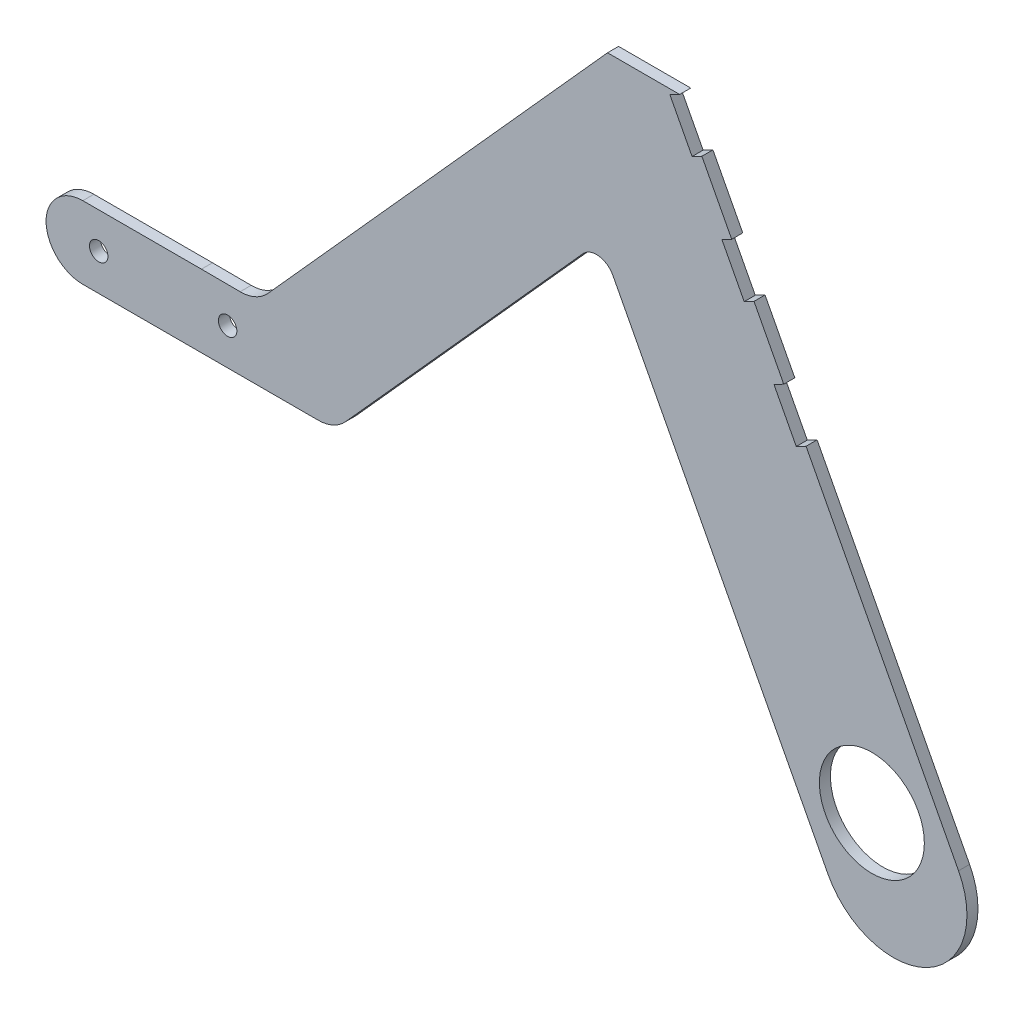
ISO-10303-21;
HEADER;
FILE_DESCRIPTION(('STEP AP214'),'2;1');
FILE_NAME('part.step','',(''),(''),'','','');
FILE_SCHEMA(('AUTOMOTIVE_DESIGN { 1 0 10303 214 1 1 1 1 }'));
ENDSEC;
DATA;
#1=APPLICATION_CONTEXT('core data for automotive mechanical design processes');
#2=APPLICATION_PROTOCOL_DEFINITION('international standard','automotive_design',2000,#1);
#3=PRODUCT_CONTEXT('',#1,'mechanical');
#4=PRODUCT('Part','Part','',(#3));
#5=PRODUCT_RELATED_PRODUCT_CATEGORY('part','',(#4));
#6=PRODUCT_DEFINITION_FORMATION('','',#4);
#7=PRODUCT_DEFINITION_CONTEXT('part definition',#1,'design');
#8=PRODUCT_DEFINITION('design','',#6,#7);
#9=PRODUCT_DEFINITION_SHAPE('','',#8);
#10=(LENGTH_UNIT() NAMED_UNIT(*) SI_UNIT(.MILLI.,.METRE.));
#11=(NAMED_UNIT(*) PLANE_ANGLE_UNIT() SI_UNIT($,.RADIAN.));
#12=(NAMED_UNIT(*) SI_UNIT($,.STERADIAN.) SOLID_ANGLE_UNIT());
#13=UNCERTAINTY_MEASURE_WITH_UNIT(LENGTH_MEASURE(1.E-05),#10,'distance_accuracy_value','');
#14=(GEOMETRIC_REPRESENTATION_CONTEXT(3) GLOBAL_UNCERTAINTY_ASSIGNED_CONTEXT((#13)) GLOBAL_UNIT_ASSIGNED_CONTEXT((#10,
#11,#12)) REPRESENTATION_CONTEXT('',''));
#15=CARTESIAN_POINT('',(0.,0.,0.));
#16=DIRECTION('',(0.,0.,1.));
#17=DIRECTION('',(1.,0.,0.));
#18=AXIS2_PLACEMENT_3D('',#15,#16,#17);
#19=CARTESIAN_POINT('',(47.5265399723287,145.283049840151,3.));
#20=DIRECTION('',(-0.886005074964163,-0.463675540801699,0.));
#21=DIRECTION('',(0.463675540801699,-0.886005074964163,0.));
#22=AXIS2_PLACEMENT_3D('',#19,#20,#21);
#23=PLANE('',#22);
#24=DIRECTION('',(-0.463675540801699,0.886005074964163,0.));
#25=VECTOR('',#24,1.);
#26=CARTESIAN_POINT('',(47.5265399723287,145.283049840151,0.));
#27=LINE('',#26,#25);
#28=CARTESIAN_POINT('',(71.0495710049199,100.334539428366,0.));
#29=VERTEX_POINT('',#28);
#30=CARTESIAN_POINT('',(62.9475619895108,115.816100290184,0.));
#31=VERTEX_POINT('',#30);
#32=EDGE_CURVE('E417',#29,#31,#27,.T.);
#33=ORIENTED_EDGE('',*,*,#32,.T.);
#34=DIRECTION('',(0.,0.,-1.));
#35=VECTOR('',#34,1.);
#36=CARTESIAN_POINT('',(62.9475619895108,115.816100290184,3.));
#37=LINE('',#36,#35);
#38=CARTESIAN_POINT('',(62.9475619895108,115.816100290184,3.));
#39=VERTEX_POINT('',#38);
#40=EDGE_CURVE('E283',#39,#31,#37,.T.);
#41=ORIENTED_EDGE('',*,*,#40,.F.);
#42=DIRECTION('',(-0.463675540801699,0.886005074964163,0.));
#43=VECTOR('',#42,1.);
#44=CARTESIAN_POINT('',(47.5265399723287,145.283049840151,3.));
#45=LINE('',#44,#43);
#46=CARTESIAN_POINT('',(71.0495710049199,100.334539428366,3.));
#47=VERTEX_POINT('',#46);
#48=EDGE_CURVE('E399',#47,#39,#45,.T.);
#49=ORIENTED_EDGE('',*,*,#48,.F.);
#50=DIRECTION('',(0.,0.,1.));
#51=VECTOR('',#50,1.);
#52=CARTESIAN_POINT('',(71.0495710049199,100.334539428366,3.));
#53=LINE('',#52,#51);
#54=EDGE_CURVE('E318',#29,#47,#53,.T.);
#55=ORIENTED_EDGE('',*,*,#54,.F.);
#56=EDGE_LOOP('',(#33,#41,#49,#55));
#57=FACE_BOUND('',#56,.T.);
#58=ADVANCED_FACE('F45',(#57),#23,.F.);
#59=CARTESIAN_POINT('',(85.1805017222918,73.3327348735877,0.));
#60=VERTEX_POINT('',#59);
#61=CARTESIAN_POINT('',(77.0996995895019,88.7737729905735,0.));
#62=VERTEX_POINT('',#61);
#63=EDGE_CURVE('E421',#60,#62,#27,.T.);
#64=ORIENTED_EDGE('',*,*,#63,.T.);
#65=DIRECTION('',(0.,0.,-1.));
#66=VECTOR('',#65,1.);
#67=CARTESIAN_POINT('',(77.0996995895019,88.7737729905735,3.));
#68=LINE('',#67,#66);
#69=CARTESIAN_POINT('',(77.0996995895018,88.7737729905735,3.));
#70=VERTEX_POINT('',#69);
#71=EDGE_CURVE('E286',#70,#62,#68,.T.);
#72=ORIENTED_EDGE('',*,*,#71,.F.);
#73=CARTESIAN_POINT('',(85.1805017222918,73.3327348735877,3.));
#74=VERTEX_POINT('',#73);
#75=EDGE_CURVE('E405',#74,#70,#45,.T.);
#76=ORIENTED_EDGE('',*,*,#75,.F.);
#77=DIRECTION('',(0.,0.,1.));
#78=VECTOR('',#77,1.);
#79=CARTESIAN_POINT('',(85.1805017222918,73.3327348735877,3.));
#80=LINE('',#79,#78);
#81=EDGE_CURVE('E351',#60,#74,#80,.T.);
#82=ORIENTED_EDGE('',*,*,#81,.F.);
#83=EDGE_LOOP('',(#64,#72,#76,#82));
#84=FACE_BOUND('',#83,.T.);
#85=ADVANCED_FACE('F563',(#84),#23,.F.);
#86=CARTESIAN_POINT('',(-135.81117841602,11.660861845859,3.));
#87=DIRECTION('',(0.,0.,-1.));
#88=DIRECTION('',(-1.,0.,0.));
#89=AXIS2_PLACEMENT_3D('',#86,#87,#88);
#90=PLANE('',#89);
#91=CARTESIAN_POINT('',(-100.811197098113,11.6246990730858,3.));
#92=DIRECTION('',(0.,0.,1.));
#93=DIRECTION('',(1.,0.,0.));
#94=AXIS2_PLACEMENT_3D('',#91,#92,#93);
#95=CIRCLE('',#94,2.5);
#96=CARTESIAN_POINT('',(-98.3111970981128,11.6246990730858,3.));
#97=VERTEX_POINT('',#96);
#98=EDGE_CURVE('E242',#97,#97,#95,.T.);
#99=ORIENTED_EDGE('',*,*,#98,.F.);
#100=EDGE_LOOP('',(#99));
#101=FACE_BOUND('',#100,.T.);
#102=CARTESIAN_POINT('',(-105.124337118393,11.3338349953504,3.));
#103=DIRECTION('',(0.,0.,-1.));
#104=DIRECTION('',(-1.,0.,0.));
#105=AXIS2_PLACEMENT_3D('',#102,#103,#104);
#106=CIRCLE('',#105,10.);
#107=CARTESIAN_POINT('',(-105.124337118393,21.3338349953504,3.));
#108=VERTEX_POINT('',#107);
#109=CARTESIAN_POINT('',(-115.123000197013,11.4973484206047,3.));
#110=VERTEX_POINT('',#109);
#111=EDGE_CURVE('E62',#108,#110,#106,.F.);
#112=ORIENTED_EDGE('',*,*,#111,.T.);
#113=CARTESIAN_POINT('',(-105.124337118393,11.660861845859,3.));
#114=DIRECTION('',(0.,0.,-1.));
#115=DIRECTION('',(-1.,0.,0.));
#116=AXIS2_PLACEMENT_3D('',#113,#114,#115);
#117=CIRCLE('',#116,10.);
#118=CARTESIAN_POINT('',(-105.124337118393,1.66086184585895,3.));
#119=VERTEX_POINT('',#118);
#120=EDGE_CURVE('E477',#110,#119,#117,.F.);
#121=ORIENTED_EDGE('',*,*,#120,.T.);
#122=DIRECTION('',(-1.,0.,0.));
#123=VECTOR('',#122,1.);
#124=CARTESIAN_POINT('',(-177.200165386353,1.66086184585895,3.));
#125=LINE('',#124,#123);
#126=CARTESIAN_POINT('',(-41.2833360384099,1.66086184585895,3.));
#127=VERTEX_POINT('',#126);
#128=EDGE_CURVE('E258',#127,#119,#125,.T.);
#129=ORIENTED_EDGE('',*,*,#128,.F.);
#130=CARTESIAN_POINT('',(-41.2833360384098,11.660861845859,3.));
#131=DIRECTION('',(0.,0.,-1.));
#132=DIRECTION('',(-1.,0.,0.));
#133=AXIS2_PLACEMENT_3D('',#130,#131,#132);
#134=CIRCLE('',#133,10.);
#135=CARTESIAN_POINT('',(-33.8452480302584,4.97693734127377,3.));
#136=VERTEX_POINT('',#135);
#137=EDGE_CURVE('E448',#127,#136,#134,.F.);
#138=ORIENTED_EDGE('',*,*,#137,.T.);
#139=DIRECTION('',(0.668392450458517,0.743808800815142,0.));
#140=VECTOR('',#139,1.);
#141=CARTESIAN_POINT('',(30.6390147016568,76.7371167107013,3.));
#142=LINE('',#141,#140);
#143=CARTESIAN_POINT('',(30.6390147016568,76.7371167107013,3.));
#144=VERTEX_POINT('',#143);
#145=EDGE_CURVE('E386',#136,#144,#142,.T.);
#146=ORIENTED_EDGE('',*,*,#145,.T.);
#147=CARTESIAN_POINT('',(34.3580587057325,73.3951544584087,3.));
#148=DIRECTION('',(0.,0.,-1.));
#149=DIRECTION('',(1.,0.,0.));
#150=AXIS2_PLACEMENT_3D('',#147,#148,#149);
#151=CIRCLE('',#150,4.99999999999999);
#152=CARTESIAN_POINT('',(38.7880840805533,75.7135321624172,3.));
#153=VERTEX_POINT('',#152);
#154=EDGE_CURVE('E389',#144,#153,#151,.T.);
#155=ORIENTED_EDGE('',*,*,#154,.T.);
#156=DIRECTION('',(0.463675540801699,-0.886005074964163,0.));
#157=VECTOR('',#156,1.);
#158=CARTESIAN_POINT('',(97.1952092686626,-35.8925474708917,3.));
#159=LINE('',#158,#157);
#160=CARTESIAN_POINT('',(97.1952092686626,-35.8925474708917,3.));
#161=VERTEX_POINT('',#160);
#162=EDGE_CURVE('E393',#153,#161,#159,.T.);
#163=ORIENTED_EDGE('',*,*,#162,.T.);
#164=CARTESIAN_POINT('',(114.915310767946,-26.6190366548578,3.));
#165=DIRECTION('',(0.,0.,1.));
#166=DIRECTION('',(-1.,0.,0.));
#167=AXIS2_PLACEMENT_3D('',#164,#165,#166);
#168=CIRCLE('',#167,20.);
#169=CARTESIAN_POINT('',(132.635412267229,-17.3455258388238,3.));
#170=VERTEX_POINT('',#169);
#171=EDGE_CURVE('E396',#161,#170,#168,.T.);
#172=ORIENTED_EDGE('',*,*,#171,.T.);
#173=CARTESIAN_POINT('',(91.2306303068737,61.7719684357956,3.));
#174=VERTEX_POINT('',#173);
#175=EDGE_CURVE('E400',#170,#174,#45,.T.);
#176=ORIENTED_EDGE('',*,*,#175,.T.);
#177=DIRECTION('',(0.886005074964163,0.463675540801699,0.));
#178=VECTOR('',#177,1.);
#179=CARTESIAN_POINT('',(88.5726150819813,60.3809418133905,3.));
#180=LINE('',#179,#178);
#181=CARTESIAN_POINT('',(88.5726150819813,60.3809418133905,3.));
#182=VERTEX_POINT('',#181);
#183=EDGE_CURVE('E337',#182,#174,#180,.T.);
#184=ORIENTED_EDGE('',*,*,#183,.F.);
#185=DIRECTION('',(0.463675540801699,-0.886005074964163,0.));
#186=VECTOR('',#185,1.);
#187=CARTESIAN_POINT('',(82.5224864973993,71.9417082511826,3.));
#188=LINE('',#187,#186);
#189=CARTESIAN_POINT('',(82.5224864973993,71.9417082511826,3.));
#190=VERTEX_POINT('',#189);
#191=EDGE_CURVE('E354',#190,#182,#188,.T.);
#192=ORIENTED_EDGE('',*,*,#191,.F.);
#193=DIRECTION('',(0.886005074964163,0.463675540801699,0.));
#194=VECTOR('',#193,1.);
#195=CARTESIAN_POINT('',(82.5224864973993,71.9417082511826,3.));
#196=LINE('',#195,#194);
#197=EDGE_CURVE('E265',#190,#74,#196,.T.);
#198=ORIENTED_EDGE('',*,*,#197,.T.);
#199=ORIENTED_EDGE('',*,*,#75,.T.);
#200=DIRECTION('',(0.886005074964163,0.463675540801699,0.));
#201=VECTOR('',#200,1.);
#202=CARTESIAN_POINT('',(74.4416843646094,87.3827463681684,3.));
#203=LINE('',#202,#201);
#204=CARTESIAN_POINT('',(74.4416843646094,87.3827463681684,3.));
#205=VERTEX_POINT('',#204);
#206=EDGE_CURVE('E302',#205,#70,#203,.T.);
#207=ORIENTED_EDGE('',*,*,#206,.F.);
#208=DIRECTION('',(0.4636755408017,-0.886005074964163,0.));
#209=VECTOR('',#208,1.);
#210=CARTESIAN_POINT('',(68.3915557800274,98.9435128059606,3.));
#211=LINE('',#210,#209);
#212=CARTESIAN_POINT('',(68.3915557800274,98.9435128059606,3.));
#213=VERTEX_POINT('',#212);
#214=EDGE_CURVE('E321',#213,#205,#211,.T.);
#215=ORIENTED_EDGE('',*,*,#214,.F.);
#216=DIRECTION('',(0.886005074964163,0.463675540801699,0.));
#217=VECTOR('',#216,1.);
#218=CARTESIAN_POINT('',(68.3915557800274,98.9435128059606,3.));
#219=LINE('',#218,#217);
#220=EDGE_CURVE('E313',#213,#47,#219,.T.);
#221=ORIENTED_EDGE('',*,*,#220,.T.);
#222=ORIENTED_EDGE('',*,*,#48,.T.);
#223=DIRECTION('',(0.886005074964163,0.463675540801699,0.));
#224=VECTOR('',#223,1.);
#225=CARTESIAN_POINT('',(60.2895467646183,114.425073667779,3.));
#226=LINE('',#225,#224);
#227=CARTESIAN_POINT('',(60.2895467646183,114.425073667779,3.));
#228=VERTEX_POINT('',#227);
#229=EDGE_CURVE('E282',#228,#39,#226,.T.);
#230=ORIENTED_EDGE('',*,*,#229,.F.);
#231=DIRECTION('',(0.4636755408017,-0.886005074964162,0.));
#232=VECTOR('',#231,1.);
#233=CARTESIAN_POINT('',(54.2606250626555,125.945317360739,3.));
#234=LINE('',#233,#232);
#235=CARTESIAN_POINT('',(54.2606250626555,125.945317360739,3.));
#236=VERTEX_POINT('',#235);
#237=EDGE_CURVE('E266',#236,#228,#234,.T.);
#238=ORIENTED_EDGE('',*,*,#237,.F.);
#239=DIRECTION('',(0.886005074964163,0.463675540801699,0.));
#240=VECTOR('',#239,1.);
#241=CARTESIAN_POINT('',(54.2606250626555,125.945317360739,3.));
#242=LINE('',#241,#240);
#243=CARTESIAN_POINT('',(56.918640287548,127.336343983144,3.));
#244=VERTEX_POINT('',#243);
#245=EDGE_CURVE('E234',#236,#244,#242,.T.);
#246=ORIENTED_EDGE('',*,*,#245,.T.);
#247=DIRECTION('',(1.,0.,0.));
#248=VECTOR('',#247,1.);
#249=CARTESIAN_POINT('',(22.3306181281122,127.336343983144,3.));
#250=LINE('',#249,#248);
#251=CARTESIAN_POINT('',(37.3306181281122,127.336343983144,3.));
#252=VERTEX_POINT('',#251);
#253=EDGE_CURVE('E217',#252,#244,#250,.T.);
#254=ORIENTED_EDGE('',*,*,#253,.F.);
#255=DIRECTION('',(-0.668121193620437,-0.744052464974885,0.));
#256=VECTOR('',#255,1.);
#257=CARTESIAN_POINT('',(-42.6343339939096,38.2834591082024,3.));
#258=LINE('',#257,#256);
#259=CARTESIAN_POINT('',(-54.9233200049385,24.5978427546783,3.));
#260=VERTEX_POINT('',#259);
#261=EDGE_CURVE('E232',#252,#260,#258,.T.);
#262=ORIENTED_EDGE('',*,*,#261,.T.);
#263=CARTESIAN_POINT('',(-62.3638446546874,31.2790546908826,3.));
#264=DIRECTION('',(0.,0.,-1.));
#265=DIRECTION('',(-1.,0.,0.));
#266=AXIS2_PLACEMENT_3D('',#263,#264,#265);
#267=CIRCLE('',#266,10.);
#268=CARTESIAN_POINT('',(-62.4158461613179,21.2791898996313,3.));
#269=VERTEX_POINT('',#268);
#270=EDGE_CURVE('E55',#260,#269,#267,.T.);
#271=ORIENTED_EDGE('',*,*,#270,.T.);
#272=DIRECTION('',(0.999986479125134,-0.00520015066304951,0.));
#273=VECTOR('',#272,1.);
#274=CARTESIAN_POINT('',(0.108965675032663,20.9540470616878,3.));
#275=LINE('',#274,#273);
#276=CARTESIAN_POINT('',(-72.9240718667576,21.3338349953504,3.));
#277=VERTEX_POINT('',#276);
#278=EDGE_CURVE('E226',#277,#269,#275,.T.);
#279=ORIENTED_EDGE('',*,*,#278,.F.);
#280=DIRECTION('',(1.,0.,0.));
#281=VECTOR('',#280,1.);
#282=CARTESIAN_POINT('',(-115.124337118393,21.3338349953504,3.));
#283=LINE('',#282,#281);
#284=EDGE_CURVE('E498',#108,#277,#283,.T.);
#285=ORIENTED_EDGE('',*,*,#284,.F.);
#286=EDGE_LOOP('',(#112,#121,#129,#138,#146,#155,#163,#172,#176,#184,#192,#198,#199,#207,#215,
#221,#222,#230,#238,#246,#254,#262,#271,#279,#285));
#287=FACE_BOUND('',#286,.T.);
#288=CARTESIAN_POINT('',(-65.8112157802054,11.5885363003127,3.));
#289=DIRECTION('',(0.,0.,1.));
#290=DIRECTION('',(1.,0.,0.));
#291=AXIS2_PLACEMENT_3D('',#288,#289,#290);
#292=CIRCLE('',#291,2.50000000000001);
#293=CARTESIAN_POINT('',(-63.3112157802054,11.5885363003127,3.));
#294=VERTEX_POINT('',#293);
#295=EDGE_CURVE('E378',#294,#294,#292,.T.);
#296=ORIENTED_EDGE('',*,*,#295,.F.);
#297=EDGE_LOOP('',(#296));
#298=FACE_BOUND('',#297,.T.);
#299=CARTESIAN_POINT('',(109.098617171966,-15.5043247668019,3.));
#300=DIRECTION('',(0.,0.,1.));
#301=DIRECTION('',(1.,0.,0.));
#302=AXIS2_PLACEMENT_3D('',#299,#300,#301);
#303=CIRCLE('',#302,14.25);
#304=CARTESIAN_POINT('',(123.348617171966,-15.5043247668019,3.));
#305=VERTEX_POINT('',#304);
#306=EDGE_CURVE('E370',#305,#305,#303,.T.);
#307=ORIENTED_EDGE('',*,*,#306,.F.);
#308=EDGE_LOOP('',(#307));
#309=FACE_BOUND('',#308,.T.);
#310=ADVANCED_FACE('F230',(#101,#287,#298,#309),#90,.F.);
#311=CARTESIAN_POINT('',(-135.81117841602,11.660861845859,0.));
#312=DIRECTION('',(0.,0.,-1.));
#313=DIRECTION('',(-1.,0.,0.));
#314=AXIS2_PLACEMENT_3D('',#311,#312,#313);
#315=PLANE('',#314);
#316=DIRECTION('',(1.,0.,0.));
#317=VECTOR('',#316,1.);
#318=CARTESIAN_POINT('',(-135.81117841602,1.66086184585895,0.));
#319=LINE('',#318,#317);
#320=CARTESIAN_POINT('',(-105.124337118393,1.66086184585895,0.));
#321=VERTEX_POINT('',#320);
#322=CARTESIAN_POINT('',(-41.2833360384098,1.66086184585895,0.));
#323=VERTEX_POINT('',#322);
#324=EDGE_CURVE('E262',#321,#323,#319,.T.);
#325=ORIENTED_EDGE('',*,*,#324,.F.);
#326=CARTESIAN_POINT('',(-105.124337118393,11.660861845859,0.));
#327=DIRECTION('',(0.,0.,-1.));
#328=DIRECTION('',(-1.,0.,0.));
#329=AXIS2_PLACEMENT_3D('',#326,#327,#328);
#330=CIRCLE('',#329,10.);
#331=CARTESIAN_POINT('',(-115.123000197013,11.4973484206047,0.));
#332=VERTEX_POINT('',#331);
#333=EDGE_CURVE('E472',#321,#332,#330,.T.);
#334=ORIENTED_EDGE('',*,*,#333,.T.);
#335=CARTESIAN_POINT('',(-105.124337118393,11.3338349953504,0.));
#336=DIRECTION('',(0.,0.,-1.));
#337=DIRECTION('',(-1.,0.,0.));
#338=AXIS2_PLACEMENT_3D('',#335,#336,#337);
#339=CIRCLE('',#338,10.);
#340=CARTESIAN_POINT('',(-105.124337118393,21.3338349953504,0.));
#341=VERTEX_POINT('',#340);
#342=EDGE_CURVE('E469',#332,#341,#339,.T.);
#343=ORIENTED_EDGE('',*,*,#342,.T.);
#344=DIRECTION('',(-1.,0.,0.));
#345=VECTOR('',#344,1.);
#346=CARTESIAN_POINT('',(-135.81117841602,21.3338349953504,0.));
#347=LINE('',#346,#345);
#348=CARTESIAN_POINT('',(-72.9240718667576,21.3338349953504,0.));
#349=VERTEX_POINT('',#348);
#350=EDGE_CURVE('E249',#349,#341,#347,.T.);
#351=ORIENTED_EDGE('',*,*,#350,.F.);
#352=DIRECTION('',(-0.999986479125134,0.00520015066304951,0.));
#353=VECTOR('',#352,1.);
#354=CARTESIAN_POINT('',(-135.759177612496,21.6605914301897,0.));
#355=LINE('',#354,#353);
#356=CARTESIAN_POINT('',(-62.4158461613179,21.2791898996313,0.));
#357=VERTEX_POINT('',#356);
#358=EDGE_CURVE('E457',#357,#349,#355,.T.);
#359=ORIENTED_EDGE('',*,*,#358,.F.);
#360=CARTESIAN_POINT('',(-62.3638446546874,31.2790546908826,0.));
#361=DIRECTION('',(0.,0.,-1.));
#362=DIRECTION('',(-1.,0.,0.));
#363=AXIS2_PLACEMENT_3D('',#360,#361,#362);
#364=CIRCLE('',#363,10.);
#365=CARTESIAN_POINT('',(-54.9233200049385,24.5978427546783,0.));
#366=VERTEX_POINT('',#365);
#367=EDGE_CURVE('E11',#357,#366,#364,.F.);
#368=ORIENTED_EDGE('',*,*,#367,.T.);
#369=DIRECTION('',(0.668121193620437,0.744052464974885,0.));
#370=VECTOR('',#369,1.);
#371=CARTESIAN_POINT('',(-97.4617178538169,-22.7749992951749,0.));
#372=LINE('',#371,#370);
#373=CARTESIAN_POINT('',(37.3306181281122,127.336343983144,0.));
#374=VERTEX_POINT('',#373);
#375=EDGE_CURVE('E451',#366,#374,#372,.T.);
#376=ORIENTED_EDGE('',*,*,#375,.T.);
#377=DIRECTION('',(-1.,0.,0.));
#378=VECTOR('',#377,1.);
#379=CARTESIAN_POINT('',(-135.81117841602,127.336343983144,0.));
#380=LINE('',#379,#378);
#381=CARTESIAN_POINT('',(56.918640287548,127.336343983144,0.));
#382=VERTEX_POINT('',#381);
#383=EDGE_CURVE('E220',#382,#374,#380,.T.);
#384=ORIENTED_EDGE('',*,*,#383,.F.);
#385=DIRECTION('',(0.886005074964163,0.463675540801699,0.));
#386=VECTOR('',#385,1.);
#387=CARTESIAN_POINT('',(54.2606250626555,125.945317360739,0.));
#388=LINE('',#387,#386);
#389=CARTESIAN_POINT('',(54.2606250626555,125.945317360739,0.));
#390=VERTEX_POINT('',#389);
#391=EDGE_CURVE('E292',#390,#382,#388,.T.);
#392=ORIENTED_EDGE('',*,*,#391,.F.);
#393=DIRECTION('',(-0.4636755408017,0.886005074964162,0.));
#394=VECTOR('',#393,1.);
#395=CARTESIAN_POINT('',(54.2606250626555,125.945317360739,0.));
#396=LINE('',#395,#394);
#397=CARTESIAN_POINT('',(60.2895467646183,114.425073667779,0.));
#398=VERTEX_POINT('',#397);
#399=EDGE_CURVE('E275',#398,#390,#396,.T.);
#400=ORIENTED_EDGE('',*,*,#399,.F.);
#401=DIRECTION('',(0.886005074964163,0.463675540801699,0.));
#402=VECTOR('',#401,1.);
#403=CARTESIAN_POINT('',(60.2895467646183,114.425073667779,0.));
#404=LINE('',#403,#402);
#405=EDGE_CURVE('E296',#398,#31,#404,.T.);
#406=ORIENTED_EDGE('',*,*,#405,.T.);
#407=ORIENTED_EDGE('',*,*,#32,.F.);
#408=DIRECTION('',(0.886005074964163,0.463675540801699,0.));
#409=VECTOR('',#408,1.);
#410=CARTESIAN_POINT('',(68.3915557800274,98.9435128059606,0.));
#411=LINE('',#410,#409);
#412=CARTESIAN_POINT('',(68.3915557800274,98.9435128059606,0.));
#413=VERTEX_POINT('',#412);
#414=EDGE_CURVE('E310',#413,#29,#411,.T.);
#415=ORIENTED_EDGE('',*,*,#414,.F.);
#416=DIRECTION('',(-0.4636755408017,0.886005074964163,0.));
#417=VECTOR('',#416,1.);
#418=CARTESIAN_POINT('',(68.3915557800274,98.9435128059606,0.));
#419=LINE('',#418,#417);
#420=CARTESIAN_POINT('',(74.4416843646094,87.3827463681684,0.));
#421=VERTEX_POINT('',#420);
#422=EDGE_CURVE('E327',#421,#413,#419,.T.);
#423=ORIENTED_EDGE('',*,*,#422,.F.);
#424=DIRECTION('',(0.886005074964163,0.463675540801699,0.));
#425=VECTOR('',#424,1.);
#426=CARTESIAN_POINT('',(74.4416843646094,87.3827463681684,0.));
#427=LINE('',#426,#425);
#428=EDGE_CURVE('E306',#421,#62,#427,.T.);
#429=ORIENTED_EDGE('',*,*,#428,.T.);
#430=ORIENTED_EDGE('',*,*,#63,.F.);
#431=DIRECTION('',(0.886005074964163,0.463675540801699,0.));
#432=VECTOR('',#431,1.);
#433=CARTESIAN_POINT('',(82.5224864973993,71.9417082511826,0.));
#434=LINE('',#433,#432);
#435=CARTESIAN_POINT('',(82.5224864973993,71.9417082511826,0.));
#436=VERTEX_POINT('',#435);
#437=EDGE_CURVE('E345',#436,#60,#434,.T.);
#438=ORIENTED_EDGE('',*,*,#437,.F.);
#439=DIRECTION('',(-0.463675540801699,0.886005074964163,0.));
#440=VECTOR('',#439,1.);
#441=CARTESIAN_POINT('',(82.5224864973993,71.9417082511826,0.));
#442=LINE('',#441,#440);
#443=CARTESIAN_POINT('',(88.5726150819813,60.3809418133905,0.));
#444=VERTEX_POINT('',#443);
#445=EDGE_CURVE('E360',#444,#436,#442,.T.);
#446=ORIENTED_EDGE('',*,*,#445,.F.);
#447=DIRECTION('',(0.886005074964163,0.463675540801699,0.));
#448=VECTOR('',#447,1.);
#449=CARTESIAN_POINT('',(88.5726150819813,60.3809418133905,0.));
#450=LINE('',#449,#448);
#451=CARTESIAN_POINT('',(91.2306303068737,61.7719684357956,0.));
#452=VERTEX_POINT('',#451);
#453=EDGE_CURVE('E341',#444,#452,#450,.T.);
#454=ORIENTED_EDGE('',*,*,#453,.T.);
#455=CARTESIAN_POINT('',(132.635412267229,-17.3455258388238,0.));
#456=VERTEX_POINT('',#455);
#457=EDGE_CURVE('E390',#456,#452,#27,.T.);
#458=ORIENTED_EDGE('',*,*,#457,.F.);
#459=CARTESIAN_POINT('',(114.915310767946,-26.6190366548578,0.));
#460=DIRECTION('',(0.,0.,1.));
#461=DIRECTION('',(-1.,0.,0.));
#462=AXIS2_PLACEMENT_3D('',#459,#460,#461);
#463=CIRCLE('',#462,20.);
#464=CARTESIAN_POINT('',(97.1952092686626,-35.8925474708917,0.));
#465=VERTEX_POINT('',#464);
#466=EDGE_CURVE('E414',#465,#456,#463,.T.);
#467=ORIENTED_EDGE('',*,*,#466,.F.);
#468=DIRECTION('',(0.463675540801699,-0.886005074964163,0.));
#469=VECTOR('',#468,1.);
#470=CARTESIAN_POINT('',(97.1952092686626,-35.8925474708917,0.));
#471=LINE('',#470,#469);
#472=CARTESIAN_POINT('',(38.7880840805533,75.7135321624172,0.));
#473=VERTEX_POINT('',#472);
#474=EDGE_CURVE('E411',#473,#465,#471,.T.);
#475=ORIENTED_EDGE('',*,*,#474,.F.);
#476=CARTESIAN_POINT('',(34.3580587057325,73.3951544584087,0.));
#477=DIRECTION('',(0.,0.,-1.));
#478=DIRECTION('',(1.,0.,0.));
#479=AXIS2_PLACEMENT_3D('',#476,#477,#478);
#480=CIRCLE('',#479,4.99999999999999);
#481=CARTESIAN_POINT('',(30.6390147016568,76.7371167107013,0.));
#482=VERTEX_POINT('',#481);
#483=EDGE_CURVE('E408',#482,#473,#480,.T.);
#484=ORIENTED_EDGE('',*,*,#483,.F.);
#485=DIRECTION('',(0.668392450458517,0.743808800815142,0.));
#486=VECTOR('',#485,1.);
#487=CARTESIAN_POINT('',(30.6390147016568,76.7371167107013,0.));
#488=LINE('',#487,#486);
#489=CARTESIAN_POINT('',(-33.8452480302584,4.97693734127377,0.));
#490=VERTEX_POINT('',#489);
#491=EDGE_CURVE('E382',#490,#482,#488,.T.);
#492=ORIENTED_EDGE('',*,*,#491,.F.);
#493=CARTESIAN_POINT('',(-41.2833360384098,11.660861845859,0.));
#494=DIRECTION('',(0.,0.,-1.));
#495=DIRECTION('',(-1.,0.,0.));
#496=AXIS2_PLACEMENT_3D('',#493,#494,#495);
#497=CIRCLE('',#496,10.);
#498=EDGE_CURVE('E441',#490,#323,#497,.T.);
#499=ORIENTED_EDGE('',*,*,#498,.T.);
#500=EDGE_LOOP('',(#325,#334,#343,#351,#359,#368,#376,#384,#392,#400,#406,#407,#415,#423,#429,
#430,#438,#446,#454,#458,#467,#475,#484,#492,#499));
#501=FACE_BOUND('',#500,.T.);
#502=CARTESIAN_POINT('',(-100.811197098113,11.6246990730858,0.));
#503=DIRECTION('',(0.,0.,-1.));
#504=DIRECTION('',(-1.,0.,0.));
#505=AXIS2_PLACEMENT_3D('',#502,#503,#504);
#506=CIRCLE('',#505,2.5);
#507=CARTESIAN_POINT('',(-103.311197098113,11.6246990730858,0.));
#508=VERTEX_POINT('',#507);
#509=EDGE_CURVE('E256',#508,#508,#506,.T.);
#510=ORIENTED_EDGE('',*,*,#509,.F.);
#511=EDGE_LOOP('',(#510));
#512=FACE_BOUND('',#511,.T.);
#513=CARTESIAN_POINT('',(-65.8112157802054,11.5885363003127,0.));
#514=DIRECTION('',(0.,0.,1.));
#515=DIRECTION('',(1.,0.,0.));
#516=AXIS2_PLACEMENT_3D('',#513,#514,#515);
#517=CIRCLE('',#516,2.50000000000001);
#518=CARTESIAN_POINT('',(-63.3112157802054,11.5885363003127,0.));
#519=VERTEX_POINT('',#518);
#520=EDGE_CURVE('E374',#519,#519,#517,.T.);
#521=ORIENTED_EDGE('',*,*,#520,.T.);
#522=EDGE_LOOP('',(#521));
#523=FACE_BOUND('',#522,.T.);
#524=CARTESIAN_POINT('',(109.098617171966,-15.5043247668019,0.));
#525=DIRECTION('',(0.,0.,1.));
#526=DIRECTION('',(1.,0.,0.));
#527=AXIS2_PLACEMENT_3D('',#524,#525,#526);
#528=CIRCLE('',#527,14.25);
#529=CARTESIAN_POINT('',(123.348617171966,-15.5043247668019,0.));
#530=VERTEX_POINT('',#529);
#531=EDGE_CURVE('E291',#530,#530,#528,.T.);
#532=ORIENTED_EDGE('',*,*,#531,.T.);
#533=EDGE_LOOP('',(#532));
#534=FACE_BOUND('',#533,.T.);
#535=ADVANCED_FACE('F494',(#501,#512,#523,#534),#315,.T.);
#536=CARTESIAN_POINT('',(30.6390147016568,76.7371167107013,3.));
#537=DIRECTION('',(-0.743808800815142,0.668392450458517,0.));
#538=DIRECTION('',(-0.668392450458517,-0.743808800815142,0.));
#539=AXIS2_PLACEMENT_3D('',#536,#537,#538);
#540=PLANE('',#539);
#541=ORIENTED_EDGE('',*,*,#145,.F.);
#542=DIRECTION('',(0.,0.,-1.));
#543=VECTOR('',#542,1.);
#544=CARTESIAN_POINT('',(-33.8452480302584,4.97693734127377,3.));
#545=LINE('',#544,#543);
#546=EDGE_CURVE('E437',#136,#490,#545,.T.);
#547=ORIENTED_EDGE('',*,*,#546,.T.);
#548=ORIENTED_EDGE('',*,*,#491,.T.);
#549=DIRECTION('',(0.,0.,-1.));
#550=VECTOR('',#549,1.);
#551=CARTESIAN_POINT('',(30.6390147016568,76.7371167107013,3.));
#552=LINE('',#551,#550);
#553=EDGE_CURVE('E433',#144,#482,#552,.T.);
#554=ORIENTED_EDGE('',*,*,#553,.F.);
#555=EDGE_LOOP('',(#541,#547,#548,#554));
#556=FACE_BOUND('',#555,.T.);
#557=ADVANCED_FACE('F522',(#556),#540,.F.);
#558=CARTESIAN_POINT('',(34.3580587057325,73.3951544584087,3.));
#559=DIRECTION('',(0.,0.,-1.));
#560=DIRECTION('',(-1.,0.,0.));
#561=AXIS2_PLACEMENT_3D('',#558,#559,#560);
#562=CYLINDRICAL_SURFACE('',#561,4.99999999999999);
#563=ORIENTED_EDGE('',*,*,#483,.T.);
#564=DIRECTION('',(0.,0.,-1.));
#565=VECTOR('',#564,1.);
#566=CARTESIAN_POINT('',(38.7880840805533,75.7135321624172,3.));
#567=LINE('',#566,#565);
#568=EDGE_CURVE('E429',#153,#473,#567,.T.);
#569=ORIENTED_EDGE('',*,*,#568,.F.);
#570=ORIENTED_EDGE('',*,*,#154,.F.);
#571=ORIENTED_EDGE('',*,*,#553,.T.);
#572=EDGE_LOOP('',(#563,#569,#570,#571));
#573=FACE_BOUND('',#572,.T.);
#574=ADVANCED_FACE('F529',(#573),#562,.F.);
#575=CARTESIAN_POINT('',(97.1952092686626,-35.8925474708917,3.));
#576=DIRECTION('',(0.886005074964163,0.463675540801699,0.));
#577=DIRECTION('',(-0.463675540801699,0.886005074964163,0.));
#578=AXIS2_PLACEMENT_3D('',#575,#576,#577);
#579=PLANE('',#578);
#580=ORIENTED_EDGE('',*,*,#474,.T.);
#581=DIRECTION('',(0.,0.,-1.));
#582=VECTOR('',#581,1.);
#583=CARTESIAN_POINT('',(97.1952092686626,-35.8925474708917,3.));
#584=LINE('',#583,#582);
#585=EDGE_CURVE('E425',#161,#465,#584,.T.);
#586=ORIENTED_EDGE('',*,*,#585,.F.);
#587=ORIENTED_EDGE('',*,*,#162,.F.);
#588=ORIENTED_EDGE('',*,*,#568,.T.);
#589=EDGE_LOOP('',(#580,#586,#587,#588));
#590=FACE_BOUND('',#589,.T.);
#591=ADVANCED_FACE('F533',(#590),#579,.F.);
#592=CARTESIAN_POINT('',(114.915310767946,-26.6190366548578,3.));
#593=DIRECTION('',(0.,0.,-1.));
#594=DIRECTION('',(-1.,0.,0.));
#595=AXIS2_PLACEMENT_3D('',#592,#593,#594);
#596=CYLINDRICAL_SURFACE('',#595,20.);
#597=ORIENTED_EDGE('',*,*,#466,.T.);
#598=DIRECTION('',(0.,0.,-1.));
#599=VECTOR('',#598,1.);
#600=CARTESIAN_POINT('',(132.635412267229,-17.3455258388238,3.));
#601=LINE('',#600,#599);
#602=EDGE_CURVE('E404',#170,#456,#601,.T.);
#603=ORIENTED_EDGE('',*,*,#602,.F.);
#604=ORIENTED_EDGE('',*,*,#171,.F.);
#605=ORIENTED_EDGE('',*,*,#585,.T.);
#606=EDGE_LOOP('',(#597,#603,#604,#605));
#607=FACE_BOUND('',#606,.T.);
#608=ADVANCED_FACE('F540',(#607),#596,.T.);
#609=ORIENTED_EDGE('',*,*,#457,.T.);
#610=DIRECTION('',(0.,0.,-1.));
#611=VECTOR('',#610,1.);
#612=CARTESIAN_POINT('',(91.2306303068737,61.7719684357956,3.));
#613=LINE('',#612,#611);
#614=EDGE_CURVE('E317',#174,#452,#613,.T.);
#615=ORIENTED_EDGE('',*,*,#614,.F.);
#616=ORIENTED_EDGE('',*,*,#175,.F.);
#617=ORIENTED_EDGE('',*,*,#602,.T.);
#618=EDGE_LOOP('',(#609,#615,#616,#617));
#619=FACE_BOUND('',#618,.T.);
#620=ADVANCED_FACE('F544',(#619),#23,.F.);
#621=CARTESIAN_POINT('',(-65.8112157802054,11.5885363003127,3.));
#622=DIRECTION('',(0.,0.,-1.));
#623=DIRECTION('',(-1.,0.,0.));
#624=AXIS2_PLACEMENT_3D('',#621,#622,#623);
#625=CYLINDRICAL_SURFACE('',#624,2.50000000000001);
#626=ORIENTED_EDGE('',*,*,#295,.T.);
#627=EDGE_LOOP('',(#626));
#628=FACE_BOUND('',#627,.T.);
#629=ORIENTED_EDGE('',*,*,#520,.F.);
#630=EDGE_LOOP('',(#629));
#631=FACE_BOUND('',#630,.T.);
#632=ADVANCED_FACE('F605',(#628,#631),#625,.F.);
#633=CARTESIAN_POINT('',(109.098617171966,-15.5043247668019,3.));
#634=DIRECTION('',(0.,0.,-1.));
#635=DIRECTION('',(-1.,0.,0.));
#636=AXIS2_PLACEMENT_3D('',#633,#634,#635);
#637=CYLINDRICAL_SURFACE('',#636,14.25);
#638=ORIENTED_EDGE('',*,*,#306,.T.);
#639=EDGE_LOOP('',(#638));
#640=FACE_BOUND('',#639,.T.);
#641=ORIENTED_EDGE('',*,*,#531,.F.);
#642=EDGE_LOOP('',(#641));
#643=FACE_BOUND('',#642,.T.);
#644=ADVANCED_FACE('F610',(#640,#643),#637,.F.);
#645=CARTESIAN_POINT('',(82.5224864973993,71.9417082511826,3.));
#646=DIRECTION('',(-0.463675540801699,0.886005074964163,0.));
#647=DIRECTION('',(-0.886005074964163,-0.463675540801699,0.));
#648=AXIS2_PLACEMENT_3D('',#645,#646,#647);
#649=PLANE('',#648);
#650=ORIENTED_EDGE('',*,*,#81,.T.);
#651=ORIENTED_EDGE('',*,*,#197,.F.);
#652=DIRECTION('',(0.,0.,1.));
#653=VECTOR('',#652,1.);
#654=CARTESIAN_POINT('',(82.5224864973993,71.9417082511826,3.));
#655=LINE('',#654,#653);
#656=EDGE_CURVE('E340',#436,#190,#655,.T.);
#657=ORIENTED_EDGE('',*,*,#656,.F.);
#658=ORIENTED_EDGE('',*,*,#437,.T.);
#659=EDGE_LOOP('',(#650,#651,#657,#658));
#660=FACE_BOUND('',#659,.T.);
#661=ADVANCED_FACE('F555',(#660),#649,.F.);
#662=CARTESIAN_POINT('',(88.5726150819813,60.3809418133905,3.));
#663=DIRECTION('',(0.463675540801699,-0.886005074964163,0.));
#664=DIRECTION('',(0.886005074964163,0.463675540801699,0.));
#665=AXIS2_PLACEMENT_3D('',#662,#663,#664);
#666=PLANE('',#665);
#667=ORIENTED_EDGE('',*,*,#614,.T.);
#668=ORIENTED_EDGE('',*,*,#453,.F.);
#669=DIRECTION('',(0.,0.,-1.));
#670=VECTOR('',#669,1.);
#671=CARTESIAN_POINT('',(88.5726150819813,60.3809418133905,3.));
#672=LINE('',#671,#670);
#673=EDGE_CURVE('E363',#182,#444,#672,.T.);
#674=ORIENTED_EDGE('',*,*,#673,.F.);
#675=ORIENTED_EDGE('',*,*,#183,.T.);
#676=EDGE_LOOP('',(#667,#668,#674,#675));
#677=FACE_BOUND('',#676,.T.);
#678=ADVANCED_FACE('F546',(#677),#666,.F.);
#679=CARTESIAN_POINT('',(94.3355760974386,49.3689037453752,0.));
#680=DIRECTION('',(0.886005074964163,0.463675540801699,0.));
#681=DIRECTION('',(-0.463675540801699,0.886005074964163,0.));
#682=AXIS2_PLACEMENT_3D('',#679,#680,#681);
#683=PLANE('',#682);
#684=ORIENTED_EDGE('',*,*,#191,.T.);
#685=ORIENTED_EDGE('',*,*,#673,.T.);
#686=ORIENTED_EDGE('',*,*,#445,.T.);
#687=ORIENTED_EDGE('',*,*,#656,.T.);
#688=EDGE_LOOP('',(#684,#685,#686,#687));
#689=FACE_BOUND('',#688,.T.);
#690=ADVANCED_FACE('F552',(#689),#683,.T.);
#691=CARTESIAN_POINT('',(68.3915557800274,98.9435128059606,3.));
#692=DIRECTION('',(-0.463675540801699,0.886005074964163,0.));
#693=DIRECTION('',(-0.886005074964163,-0.463675540801699,0.));
#694=AXIS2_PLACEMENT_3D('',#691,#692,#693);
#695=PLANE('',#694);
#696=ORIENTED_EDGE('',*,*,#54,.T.);
#697=ORIENTED_EDGE('',*,*,#220,.F.);
#698=DIRECTION('',(0.,0.,1.));
#699=VECTOR('',#698,1.);
#700=CARTESIAN_POINT('',(68.3915557800274,98.9435128059606,3.));
#701=LINE('',#700,#699);
#702=EDGE_CURVE('E305',#413,#213,#701,.T.);
#703=ORIENTED_EDGE('',*,*,#702,.F.);
#704=ORIENTED_EDGE('',*,*,#414,.T.);
#705=EDGE_LOOP('',(#696,#697,#703,#704));
#706=FACE_BOUND('',#705,.T.);
#707=ADVANCED_FACE('F707',(#706),#695,.F.);
#708=CARTESIAN_POINT('',(74.4416843646094,87.3827463681684,3.));
#709=DIRECTION('',(0.463675540801699,-0.886005074964163,0.));
#710=DIRECTION('',(0.886005074964163,0.463675540801699,0.));
#711=AXIS2_PLACEMENT_3D('',#708,#709,#710);
#712=PLANE('',#711);
#713=ORIENTED_EDGE('',*,*,#71,.T.);
#714=ORIENTED_EDGE('',*,*,#428,.F.);
#715=DIRECTION('',(0.,0.,-1.));
#716=VECTOR('',#715,1.);
#717=CARTESIAN_POINT('',(74.4416843646094,87.3827463681684,3.));
#718=LINE('',#717,#716);
#719=EDGE_CURVE('E330',#205,#421,#718,.T.);
#720=ORIENTED_EDGE('',*,*,#719,.F.);
#721=ORIENTED_EDGE('',*,*,#206,.T.);
#722=EDGE_LOOP('',(#713,#714,#720,#721));
#723=FACE_BOUND('',#722,.T.);
#724=ADVANCED_FACE('F593',(#723),#712,.F.);
#725=CARTESIAN_POINT('',(94.3355760974387,49.3689037453753,0.));
#726=DIRECTION('',(0.886005074964163,0.4636755408017,0.));
#727=DIRECTION('',(-0.4636755408017,0.886005074964163,0.));
#728=AXIS2_PLACEMENT_3D('',#725,#726,#727);
#729=PLANE('',#728);
#730=ORIENTED_EDGE('',*,*,#214,.T.);
#731=ORIENTED_EDGE('',*,*,#719,.T.);
#732=ORIENTED_EDGE('',*,*,#422,.T.);
#733=ORIENTED_EDGE('',*,*,#702,.T.);
#734=EDGE_LOOP('',(#730,#731,#732,#733));
#735=FACE_BOUND('',#734,.T.);
#736=ADVANCED_FACE('F586',(#735),#729,.T.);
#737=CARTESIAN_POINT('',(54.2606250626555,125.945317360739,3.));
#738=DIRECTION('',(-0.463675540801699,0.886005074964163,0.));
#739=DIRECTION('',(-0.886005074964163,-0.463675540801699,0.));
#740=AXIS2_PLACEMENT_3D('',#737,#738,#739);
#741=PLANE('',#740);
#742=DIRECTION('',(0.,0.,1.));
#743=VECTOR('',#742,1.);
#744=CARTESIAN_POINT('',(56.918640287548,127.336343983144,3.));
#745=LINE('',#744,#743);
#746=EDGE_CURVE('E271',#382,#244,#745,.T.);
#747=ORIENTED_EDGE('',*,*,#746,.T.);
#748=ORIENTED_EDGE('',*,*,#245,.F.);
#749=DIRECTION('',(0.,0.,1.));
#750=VECTOR('',#749,1.);
#751=CARTESIAN_POINT('',(54.2606250626555,125.945317360739,3.));
#752=LINE('',#751,#750);
#753=EDGE_CURVE('E278',#390,#236,#752,.T.);
#754=ORIENTED_EDGE('',*,*,#753,.F.);
#755=ORIENTED_EDGE('',*,*,#391,.T.);
#756=EDGE_LOOP('',(#747,#748,#754,#755));
#757=FACE_BOUND('',#756,.T.);
#758=ADVANCED_FACE('F584',(#757),#741,.F.);
#759=CARTESIAN_POINT('',(60.2895467646183,114.425073667779,3.));
#760=DIRECTION('',(0.463675540801699,-0.886005074964163,0.));
#761=DIRECTION('',(0.886005074964163,0.463675540801699,0.));
#762=AXIS2_PLACEMENT_3D('',#759,#760,#761);
#763=PLANE('',#762);
#764=ORIENTED_EDGE('',*,*,#40,.T.);
#765=ORIENTED_EDGE('',*,*,#405,.F.);
#766=DIRECTION('',(0.,0.,-1.));
#767=VECTOR('',#766,1.);
#768=CARTESIAN_POINT('',(60.2895467646183,114.425073667779,3.));
#769=LINE('',#768,#767);
#770=EDGE_CURVE('E270',#228,#398,#769,.T.);
#771=ORIENTED_EDGE('',*,*,#770,.F.);
#772=ORIENTED_EDGE('',*,*,#229,.T.);
#773=EDGE_LOOP('',(#764,#765,#771,#772));
#774=FACE_BOUND('',#773,.T.);
#775=ADVANCED_FACE('F576',(#774),#763,.F.);
#776=CARTESIAN_POINT('',(94.3355760974387,49.3689037453753,0.));
#777=DIRECTION('',(0.886005074964163,0.4636755408017,0.));
#778=DIRECTION('',(-0.4636755408017,0.886005074964163,0.));
#779=AXIS2_PLACEMENT_3D('',#776,#777,#778);
#780=PLANE('',#779);
#781=ORIENTED_EDGE('',*,*,#237,.T.);
#782=ORIENTED_EDGE('',*,*,#770,.T.);
#783=ORIENTED_EDGE('',*,*,#399,.T.);
#784=ORIENTED_EDGE('',*,*,#753,.T.);
#785=EDGE_LOOP('',(#781,#782,#783,#784));
#786=FACE_BOUND('',#785,.T.);
#787=ADVANCED_FACE('F582',(#786),#780,.T.);
#788=CARTESIAN_POINT('',(-177.200165386353,1.66086184585895,-7.));
#789=DIRECTION('',(0.,1.,0.));
#790=DIRECTION('',(0.,0.,1.));
#791=AXIS2_PLACEMENT_3D('',#788,#789,#790);
#792=PLANE('',#791);
#793=ORIENTED_EDGE('',*,*,#128,.T.);
#794=DIRECTION('',(0.,0.,-1.));
#795=VECTOR('',#794,1.);
#796=CARTESIAN_POINT('',(-105.124337118393,1.66086184585895,-7.));
#797=LINE('',#796,#795);
#798=EDGE_CURVE('E465',#119,#321,#797,.T.);
#799=ORIENTED_EDGE('',*,*,#798,.T.);
#800=ORIENTED_EDGE('',*,*,#324,.T.);
#801=DIRECTION('',(0.,0.,-1.));
#802=VECTOR('',#801,1.);
#803=CARTESIAN_POINT('',(-41.2833360384099,1.66086184585895,-7.));
#804=LINE('',#803,#802);
#805=EDGE_CURVE('E445',#323,#127,#804,.F.);
#806=ORIENTED_EDGE('',*,*,#805,.T.);
#807=EDGE_LOOP('',(#793,#799,#800,#806));
#808=FACE_BOUND('',#807,.T.);
#809=ADVANCED_FACE('F514',(#808),#792,.F.);
#810=CARTESIAN_POINT('',(-41.2833360384098,11.660861845859,3.));
#811=DIRECTION('',(0.,0.,-1.));
#812=DIRECTION('',(-1.,0.,0.));
#813=AXIS2_PLACEMENT_3D('',#810,#811,#812);
#814=CYLINDRICAL_SURFACE('',#813,10.);
#815=ORIENTED_EDGE('',*,*,#137,.F.);
#816=ORIENTED_EDGE('',*,*,#805,.F.);
#817=ORIENTED_EDGE('',*,*,#498,.F.);
#818=ORIENTED_EDGE('',*,*,#546,.F.);
#819=EDGE_LOOP('',(#815,#816,#817,#818));
#820=FACE_BOUND('',#819,.T.);
#821=ADVANCED_FACE('F520',(#820),#814,.T.);
#822=CARTESIAN_POINT('',(-42.6343339939096,38.2834591082024,-7.));
#823=DIRECTION('',(-0.744052464974885,0.668121193620437,0.));
#824=DIRECTION('',(-0.668121193620437,-0.744052464974885,0.));
#825=AXIS2_PLACEMENT_3D('',#822,#823,#824);
#826=PLANE('',#825);
#827=ORIENTED_EDGE('',*,*,#375,.F.);
#828=DIRECTION('',(0.,0.,1.));
#829=VECTOR('',#828,1.);
#830=CARTESIAN_POINT('',(-54.9233200049385,24.5978427546783,-7.));
#831=LINE('',#830,#829);
#832=EDGE_CURVE('E240',#366,#260,#831,.T.);
#833=ORIENTED_EDGE('',*,*,#832,.T.);
#834=ORIENTED_EDGE('',*,*,#261,.F.);
#835=DIRECTION('',(0.,0.,1.));
#836=VECTOR('',#835,1.);
#837=CARTESIAN_POINT('',(37.3306181281122,127.336343983144,-7.));
#838=LINE('',#837,#836);
#839=EDGE_CURVE('E214',#374,#252,#838,.T.);
#840=ORIENTED_EDGE('',*,*,#839,.F.);
#841=EDGE_LOOP('',(#827,#833,#834,#840));
#842=FACE_BOUND('',#841,.T.);
#843=ADVANCED_FACE('F238',(#842),#826,.T.);
#844=CARTESIAN_POINT('',(0.108965675032663,20.9540470616878,-7.));
#845=DIRECTION('',(-0.00520015066304951,-0.999986479125134,0.));
#846=DIRECTION('',(0.999986479125134,-0.00520015066304951,0.));
#847=AXIS2_PLACEMENT_3D('',#844,#845,#846);
#848=PLANE('',#847);
#849=ORIENTED_EDGE('',*,*,#278,.T.);
#850=DIRECTION('',(0.,0.,1.));
#851=VECTOR('',#850,1.);
#852=CARTESIAN_POINT('',(-62.4158461613179,21.2791898996313,-7.));
#853=LINE('',#852,#851);
#854=EDGE_CURVE('E462',#269,#357,#853,.F.);
#855=ORIENTED_EDGE('',*,*,#854,.T.);
#856=ORIENTED_EDGE('',*,*,#358,.T.);
#857=DIRECTION('',(0.,0.,1.));
#858=VECTOR('',#857,1.);
#859=CARTESIAN_POINT('',(-72.9240718667576,21.3338349953504,-7.));
#860=LINE('',#859,#858);
#861=EDGE_CURVE('E225',#349,#277,#860,.T.);
#862=ORIENTED_EDGE('',*,*,#861,.T.);
#863=EDGE_LOOP('',(#849,#855,#856,#862));
#864=FACE_BOUND('',#863,.T.);
#865=ADVANCED_FACE('F487',(#864),#848,.F.);
#866=CARTESIAN_POINT('',(-100.811197098113,11.6246990730858,-7.));
#867=DIRECTION('',(0.,0.,1.));
#868=DIRECTION('',(1.,0.,0.));
#869=AXIS2_PLACEMENT_3D('',#866,#867,#868);
#870=CYLINDRICAL_SURFACE('',#869,2.5);
#871=ORIENTED_EDGE('',*,*,#509,.T.);
#872=EDGE_LOOP('',(#871));
#873=FACE_BOUND('',#872,.T.);
#874=ORIENTED_EDGE('',*,*,#98,.T.);
#875=EDGE_LOOP('',(#874));
#876=FACE_BOUND('',#875,.T.);
#877=ADVANCED_FACE('F648',(#873,#876),#870,.F.);
#878=CARTESIAN_POINT('',(-115.124337118393,21.3338349953504,-7.));
#879=DIRECTION('',(0.,-1.,0.));
#880=DIRECTION('',(0.,0.,-1.));
#881=AXIS2_PLACEMENT_3D('',#878,#879,#880);
#882=PLANE('',#881);
#883=ORIENTED_EDGE('',*,*,#350,.T.);
#884=DIRECTION('',(0.,0.,1.));
#885=VECTOR('',#884,1.);
#886=CARTESIAN_POINT('',(-105.124337118393,21.3338349953504,-7.));
#887=LINE('',#886,#885);
#888=EDGE_CURVE('E70',#341,#108,#887,.T.);
#889=ORIENTED_EDGE('',*,*,#888,.T.);
#890=ORIENTED_EDGE('',*,*,#284,.T.);
#891=ORIENTED_EDGE('',*,*,#861,.F.);
#892=EDGE_LOOP('',(#883,#889,#890,#891));
#893=FACE_BOUND('',#892,.T.);
#894=ADVANCED_FACE('F497',(#893),#882,.F.);
#895=CARTESIAN_POINT('',(22.3306181281122,127.336343983144,-7.));
#896=DIRECTION('',(0.,-1.,0.));
#897=DIRECTION('',(0.,0.,-1.));
#898=AXIS2_PLACEMENT_3D('',#895,#896,#897);
#899=PLANE('',#898);
#900=ORIENTED_EDGE('',*,*,#383,.T.);
#901=ORIENTED_EDGE('',*,*,#839,.T.);
#902=ORIENTED_EDGE('',*,*,#253,.T.);
#903=ORIENTED_EDGE('',*,*,#746,.F.);
#904=EDGE_LOOP('',(#900,#901,#902,#903));
#905=FACE_BOUND('',#904,.T.);
#906=ADVANCED_FACE('F216',(#905),#899,.F.);
#907=CARTESIAN_POINT('',(-62.3638446546874,31.2790546908826,-7.));
#908=DIRECTION('',(0.,0.,1.));
#909=DIRECTION('',(1.,0.,0.));
#910=AXIS2_PLACEMENT_3D('',#907,#908,#909);
#911=CYLINDRICAL_SURFACE('',#910,10.);
#912=ORIENTED_EDGE('',*,*,#367,.F.);
#913=ORIENTED_EDGE('',*,*,#854,.F.);
#914=ORIENTED_EDGE('',*,*,#270,.F.);
#915=ORIENTED_EDGE('',*,*,#832,.F.);
#916=EDGE_LOOP('',(#912,#913,#914,#915));
#917=FACE_BOUND('',#916,.T.);
#918=ADVANCED_FACE('F491',(#917),#911,.F.);
#919=CARTESIAN_POINT('',(-105.124337118393,11.3338349953504,-7.));
#920=DIRECTION('',(0.,0.,1.));
#921=DIRECTION('',(1.,0.,0.));
#922=AXIS2_PLACEMENT_3D('',#919,#920,#921);
#923=CYLINDRICAL_SURFACE('',#922,10.);
#924=DIRECTION('',(0.,0.,1.));
#925=VECTOR('',#924,1.);
#926=CARTESIAN_POINT('',(-115.123000197013,11.4973484206047,1.5));
#927=LINE('',#926,#925);
#928=EDGE_CURVE('E49',#110,#332,#927,.F.);
#929=ORIENTED_EDGE('',*,*,#928,.F.);
#930=ORIENTED_EDGE('',*,*,#111,.F.);
#931=ORIENTED_EDGE('',*,*,#888,.F.);
#932=ORIENTED_EDGE('',*,*,#342,.F.);
#933=EDGE_LOOP('',(#929,#930,#931,#932));
#934=FACE_BOUND('',#933,.T.);
#935=ADVANCED_FACE('F47',(#934),#923,.T.);
#936=CARTESIAN_POINT('',(-105.124337118393,11.660861845859,-7.));
#937=DIRECTION('',(0.,0.,-1.));
#938=DIRECTION('',(-1.,0.,0.));
#939=AXIS2_PLACEMENT_3D('',#936,#937,#938);
#940=CYLINDRICAL_SURFACE('',#939,10.);
#941=ORIENTED_EDGE('',*,*,#120,.F.);
#942=ORIENTED_EDGE('',*,*,#928,.T.);
#943=ORIENTED_EDGE('',*,*,#333,.F.);
#944=ORIENTED_EDGE('',*,*,#798,.F.);
#945=EDGE_LOOP('',(#941,#942,#943,#944));
#946=FACE_BOUND('',#945,.T.);
#947=ADVANCED_FACE('F507',(#946),#940,.T.);
#948=CLOSED_SHELL('',(#58,#85,#310,#535,#557,#574,#591,#608,#620,#632,#644,#661,#678,#690,#707,
#724,#736,#758,#775,#787,#809,#821,#843,#865,#877,#894,#906,#918,#935,#947));
#949=MANIFOLD_SOLID_BREP('B2',#948);
#950=ADVANCED_BREP_SHAPE_REPRESENTATION('',(#18,#949),#14);
#951=SHAPE_DEFINITION_REPRESENTATION(#9,#950);
ENDSEC;
END-ISO-10303-21;
